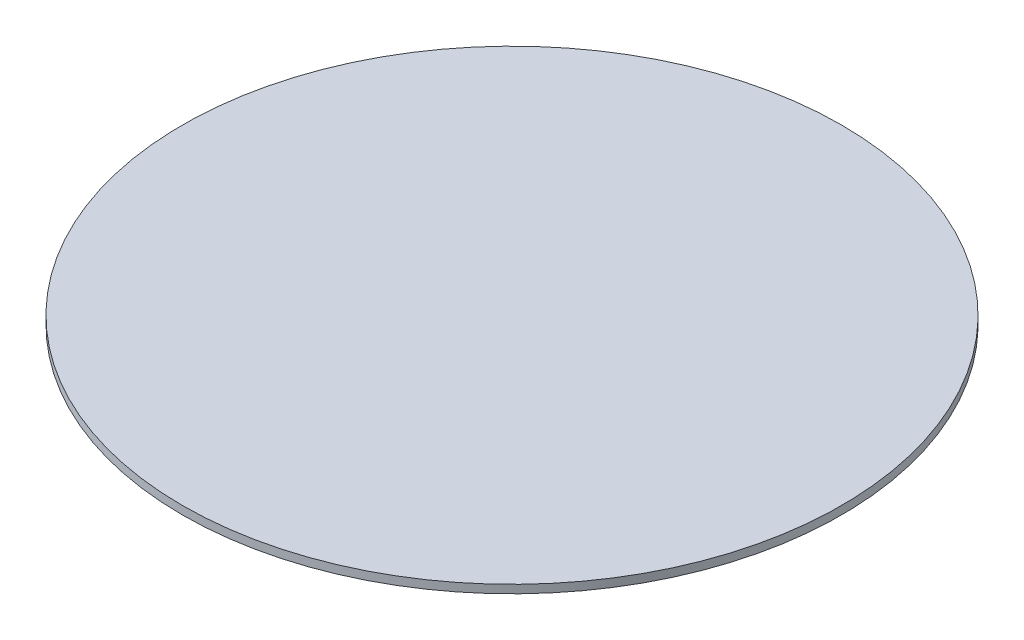
ISO-10303-21;
HEADER;
FILE_DESCRIPTION(('STEP AP214'),'2;1');
FILE_NAME('part.step','',(''),(''),'','','');
FILE_SCHEMA(('AUTOMOTIVE_DESIGN { 1 0 10303 214 1 1 1 1 }'));
ENDSEC;
DATA;
#1=APPLICATION_CONTEXT('core data for automotive mechanical design processes');
#2=APPLICATION_PROTOCOL_DEFINITION('international standard','automotive_design',2000,#1);
#3=PRODUCT_CONTEXT('',#1,'mechanical');
#4=PRODUCT('Part','Part','',(#3));
#5=PRODUCT_RELATED_PRODUCT_CATEGORY('part','',(#4));
#6=PRODUCT_DEFINITION_FORMATION('','',#4);
#7=PRODUCT_DEFINITION_CONTEXT('part definition',#1,'design');
#8=PRODUCT_DEFINITION('design','',#6,#7);
#9=PRODUCT_DEFINITION_SHAPE('','',#8);
#10=(LENGTH_UNIT() NAMED_UNIT(*) SI_UNIT(.MILLI.,.METRE.));
#11=(NAMED_UNIT(*) PLANE_ANGLE_UNIT() SI_UNIT($,.RADIAN.));
#12=(NAMED_UNIT(*) SI_UNIT($,.STERADIAN.) SOLID_ANGLE_UNIT());
#13=UNCERTAINTY_MEASURE_WITH_UNIT(LENGTH_MEASURE(1.E-05),#10,'distance_accuracy_value','');
#14=(GEOMETRIC_REPRESENTATION_CONTEXT(3) GLOBAL_UNCERTAINTY_ASSIGNED_CONTEXT((#13)) GLOBAL_UNIT_ASSIGNED_CONTEXT((#10,
#11,#12)) REPRESENTATION_CONTEXT('',''));
#15=CARTESIAN_POINT('',(0.,0.,0.));
#16=DIRECTION('',(0.,0.,1.));
#17=DIRECTION('',(1.,0.,0.));
#18=AXIS2_PLACEMENT_3D('',#15,#16,#17);
#19=CARTESIAN_POINT('',(0.,3.175,0.));
#20=DIRECTION('',(0.,-1.,0.));
#21=DIRECTION('',(0.,0.,-1.));
#22=AXIS2_PLACEMENT_3D('',#19,#20,#21);
#23=CYLINDRICAL_SURFACE('',#22,127.);
#24=CARTESIAN_POINT('',(0.,3.175,0.));
#25=DIRECTION('',(0.,1.,0.));
#26=DIRECTION('',(0.,0.,1.));
#27=AXIS2_PLACEMENT_3D('',#24,#25,#26);
#28=CIRCLE('',#27,127.);
#29=CARTESIAN_POINT('',(0.,3.175,127.));
#30=VERTEX_POINT('',#29);
#31=EDGE_CURVE('E10',#30,#30,#28,.T.);
#32=ORIENTED_EDGE('',*,*,#31,.F.);
#33=EDGE_LOOP('',(#32));
#34=FACE_BOUND('',#33,.T.);
#35=CARTESIAN_POINT('',(0.,0.,0.));
#36=DIRECTION('',(0.,1.,0.));
#37=DIRECTION('',(0.,0.,1.));
#38=AXIS2_PLACEMENT_3D('',#35,#36,#37);
#39=CIRCLE('',#38,127.);
#40=CARTESIAN_POINT('',(0.,0.,127.));
#41=VERTEX_POINT('',#40);
#42=EDGE_CURVE('E33',#41,#41,#39,.T.);
#43=ORIENTED_EDGE('',*,*,#42,.T.);
#44=EDGE_LOOP('',(#43));
#45=FACE_BOUND('',#44,.T.);
#46=ADVANCED_FACE('F30',(#34,#45),#23,.T.);
#47=CARTESIAN_POINT('',(0.,3.175,0.));
#48=DIRECTION('',(0.,1.,0.));
#49=DIRECTION('',(0.,0.,1.));
#50=AXIS2_PLACEMENT_3D('',#47,#48,#49);
#51=PLANE('',#50);
#52=ORIENTED_EDGE('',*,*,#31,.T.);
#53=EDGE_LOOP('',(#52));
#54=FACE_BOUND('',#53,.T.);
#55=ADVANCED_FACE('F45',(#54),#51,.T.);
#56=CARTESIAN_POINT('',(0.,0.,0.));
#57=DIRECTION('',(0.,1.,0.));
#58=DIRECTION('',(0.,0.,1.));
#59=AXIS2_PLACEMENT_3D('',#56,#57,#58);
#60=PLANE('',#59);
#61=ORIENTED_EDGE('',*,*,#42,.F.);
#62=EDGE_LOOP('',(#61));
#63=FACE_BOUND('',#62,.T.);
#64=ADVANCED_FACE('F43',(#63),#60,.F.);
#65=CLOSED_SHELL('',(#46,#55,#64));
#66=MANIFOLD_SOLID_BREP('B2',#65);
#67=ADVANCED_BREP_SHAPE_REPRESENTATION('',(#18,#66),#14);
#68=SHAPE_DEFINITION_REPRESENTATION(#9,#67);
ENDSEC;
END-ISO-10303-21;
